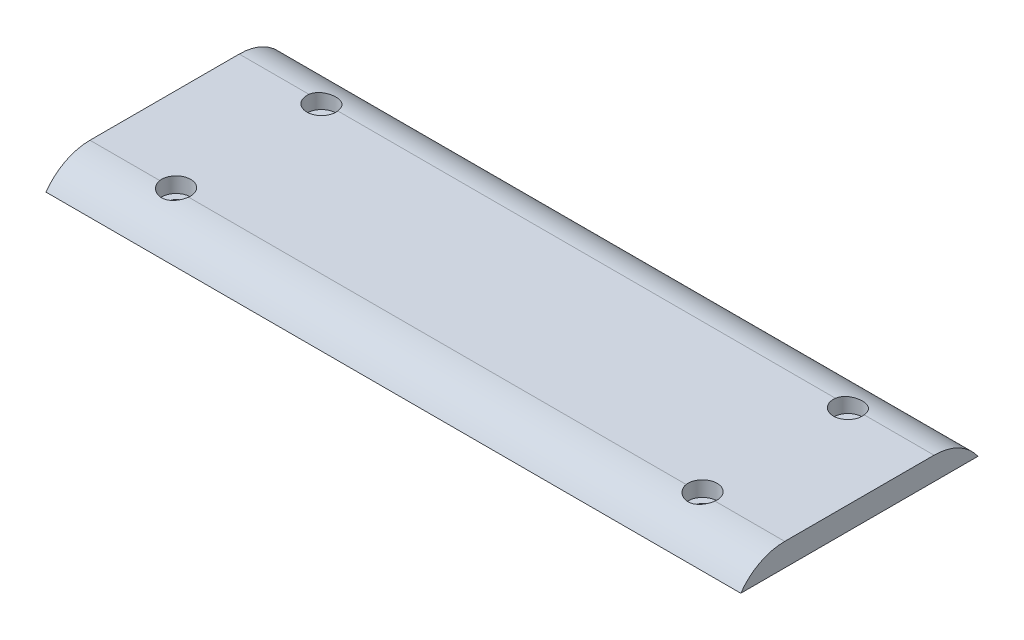
ISO-10303-21;
HEADER;
FILE_DESCRIPTION(('STEP AP214'),'2;1');
FILE_NAME('part.step','',(''),(''),'','','');
FILE_SCHEMA(('AUTOMOTIVE_DESIGN { 1 0 10303 214 1 1 1 1 }'));
ENDSEC;
DATA;
#1=APPLICATION_CONTEXT('core data for automotive mechanical design processes');
#2=APPLICATION_PROTOCOL_DEFINITION('international standard','automotive_design',2000,#1);
#3=PRODUCT_CONTEXT('',#1,'mechanical');
#4=PRODUCT('Part','Part','',(#3));
#5=PRODUCT_RELATED_PRODUCT_CATEGORY('part','',(#4));
#6=PRODUCT_DEFINITION_FORMATION('','',#4);
#7=PRODUCT_DEFINITION_CONTEXT('part definition',#1,'design');
#8=PRODUCT_DEFINITION('design','',#6,#7);
#9=PRODUCT_DEFINITION_SHAPE('','',#8);
#10=(LENGTH_UNIT() NAMED_UNIT(*) SI_UNIT(.MILLI.,.METRE.));
#11=(NAMED_UNIT(*) PLANE_ANGLE_UNIT() SI_UNIT($,.RADIAN.));
#12=(NAMED_UNIT(*) SI_UNIT($,.STERADIAN.) SOLID_ANGLE_UNIT());
#13=UNCERTAINTY_MEASURE_WITH_UNIT(LENGTH_MEASURE(1.E-05),#10,'distance_accuracy_value','');
#14=(GEOMETRIC_REPRESENTATION_CONTEXT(3) GLOBAL_UNCERTAINTY_ASSIGNED_CONTEXT((#13)) GLOBAL_UNIT_ASSIGNED_CONTEXT((#10,
#11,#12)) REPRESENTATION_CONTEXT('',''));
#15=CARTESIAN_POINT('',(0.,0.,0.));
#16=DIRECTION('',(0.,0.,1.));
#17=DIRECTION('',(1.,0.,0.));
#18=AXIS2_PLACEMENT_3D('',#15,#16,#17);
#19=CARTESIAN_POINT('',(0.,0.,0.));
#20=DIRECTION('',(0.,1.,0.));
#21=DIRECTION('',(0.,0.,1.));
#22=AXIS2_PLACEMENT_3D('',#19,#20,#21);
#23=PLANE('',#22);
#24=DIRECTION('',(0.,0.,1.));
#25=VECTOR('',#24,1.);
#26=CARTESIAN_POINT('',(-45.4,0.,-15.5));
#27=LINE('',#26,#25);
#28=CARTESIAN_POINT('',(-45.4,0.,-15.5));
#29=VERTEX_POINT('',#28);
#30=CARTESIAN_POINT('',(-45.4,0.,15.5));
#31=VERTEX_POINT('',#30);
#32=EDGE_CURVE('E220',#29,#31,#27,.T.);
#33=ORIENTED_EDGE('',*,*,#32,.F.);
#34=DIRECTION('',(-1.,0.,0.));
#35=VECTOR('',#34,1.);
#36=CARTESIAN_POINT('',(-45.4,0.,-15.5));
#37=LINE('',#36,#35);
#38=CARTESIAN_POINT('',(45.4,0.,-15.5));
#39=VERTEX_POINT('',#38);
#40=EDGE_CURVE('E226',#39,#29,#37,.T.);
#41=ORIENTED_EDGE('',*,*,#40,.F.);
#42=DIRECTION('',(0.,0.,-1.));
#43=VECTOR('',#42,1.);
#44=CARTESIAN_POINT('',(45.4,0.,-15.5));
#45=LINE('',#44,#43);
#46=CARTESIAN_POINT('',(45.4,0.,15.5));
#47=VERTEX_POINT('',#46);
#48=EDGE_CURVE('E237',#47,#39,#45,.T.);
#49=ORIENTED_EDGE('',*,*,#48,.F.);
#50=DIRECTION('',(1.,0.,0.));
#51=VECTOR('',#50,1.);
#52=CARTESIAN_POINT('',(-45.4,0.,15.5));
#53=LINE('',#52,#51);
#54=EDGE_CURVE('E233',#31,#47,#53,.T.);
#55=ORIENTED_EDGE('',*,*,#54,.F.);
#56=EDGE_LOOP('',(#33,#41,#49,#55));
#57=FACE_BOUND('',#56,.T.);
#58=CARTESIAN_POINT('',(-34.4,0.,-9.5));
#59=DIRECTION('',(0.,1.,0.));
#60=DIRECTION('',(0.,0.,1.));
#61=AXIS2_PLACEMENT_3D('',#58,#59,#60);
#62=CIRCLE('',#61,0.950000000000001);
#63=CARTESIAN_POINT('',(-34.4,0.,-8.55));
#64=VERTEX_POINT('',#63);
#65=EDGE_CURVE('E213',#64,#64,#62,.T.);
#66=ORIENTED_EDGE('',*,*,#65,.T.);
#67=EDGE_LOOP('',(#66));
#68=FACE_BOUND('',#67,.T.);
#69=CARTESIAN_POINT('',(34.4,0.,9.50000000000001));
#70=DIRECTION('',(0.,1.,0.));
#71=DIRECTION('',(0.,0.,1.));
#72=AXIS2_PLACEMENT_3D('',#69,#70,#71);
#73=CIRCLE('',#72,0.950000000000001);
#74=CARTESIAN_POINT('',(34.4,0.,10.45));
#75=VERTEX_POINT('',#74);
#76=EDGE_CURVE('E203',#75,#75,#73,.T.);
#77=ORIENTED_EDGE('',*,*,#76,.T.);
#78=EDGE_LOOP('',(#77));
#79=FACE_BOUND('',#78,.T.);
#80=CARTESIAN_POINT('',(-34.4,0.,9.50000000000001));
#81=DIRECTION('',(0.,1.,0.));
#82=DIRECTION('',(0.,0.,1.));
#83=AXIS2_PLACEMENT_3D('',#80,#81,#82);
#84=CIRCLE('',#83,0.950000000000001);
#85=CARTESIAN_POINT('',(-34.4,0.,10.45));
#86=VERTEX_POINT('',#85);
#87=EDGE_CURVE('E207',#86,#86,#84,.T.);
#88=ORIENTED_EDGE('',*,*,#87,.T.);
#89=EDGE_LOOP('',(#88));
#90=FACE_BOUND('',#89,.T.);
#91=CARTESIAN_POINT('',(34.4,0.,-9.50000000000001));
#92=DIRECTION('',(0.,1.,0.));
#93=DIRECTION('',(0.,0.,1.));
#94=AXIS2_PLACEMENT_3D('',#91,#92,#93);
#95=CIRCLE('',#94,0.950000000000001);
#96=CARTESIAN_POINT('',(34.4,0.,-8.55000000000001));
#97=VERTEX_POINT('',#96);
#98=EDGE_CURVE('E209',#97,#97,#95,.T.);
#99=ORIENTED_EDGE('',*,*,#98,.T.);
#100=EDGE_LOOP('',(#99));
#101=FACE_BOUND('',#100,.T.);
#102=DIRECTION('',(0.,0.,-1.));
#103=VECTOR('',#102,1.);
#104=CARTESIAN_POINT('',(-27.,0.,3.5));
#105=LINE('',#104,#103);
#106=CARTESIAN_POINT('',(-27.,0.,3.5));
#107=VERTEX_POINT('',#106);
#108=CARTESIAN_POINT('',(-27.,0.,-3.5));
#109=VERTEX_POINT('',#108);
#110=EDGE_CURVE('E145',#107,#109,#105,.T.);
#111=ORIENTED_EDGE('',*,*,#110,.F.);
#112=DIRECTION('',(-1.,0.,0.));
#113=VECTOR('',#112,1.);
#114=CARTESIAN_POINT('',(-27.,0.,3.5));
#115=LINE('',#114,#113);
#116=CARTESIAN_POINT('',(27.,0.,3.5));
#117=VERTEX_POINT('',#116);
#118=EDGE_CURVE('E563',#117,#107,#115,.T.);
#119=ORIENTED_EDGE('',*,*,#118,.F.);
#120=DIRECTION('',(0.,0.,1.));
#121=VECTOR('',#120,1.);
#122=CARTESIAN_POINT('',(27.,0.,3.5));
#123=LINE('',#122,#121);
#124=CARTESIAN_POINT('',(27.,0.,-3.5));
#125=VERTEX_POINT('',#124);
#126=EDGE_CURVE('E568',#125,#117,#123,.T.);
#127=ORIENTED_EDGE('',*,*,#126,.F.);
#128=DIRECTION('',(1.,0.,0.));
#129=VECTOR('',#128,1.);
#130=CARTESIAN_POINT('',(-27.,0.,-3.5));
#131=LINE('',#130,#129);
#132=EDGE_CURVE('E159',#109,#125,#131,.T.);
#133=ORIENTED_EDGE('',*,*,#132,.F.);
#134=EDGE_LOOP('',(#111,#119,#127,#133));
#135=FACE_BOUND('',#134,.T.);
#136=ADVANCED_FACE('F39',(#57,#68,#79,#90,#101,#135),#23,.F.);
#137=CARTESIAN_POINT('',(-34.4,0.,-9.5));
#138=DIRECTION('',(0.,1.,0.));
#139=DIRECTION('',(0.,0.,1.));
#140=AXIS2_PLACEMENT_3D('',#137,#138,#139);
#141=CYLINDRICAL_SURFACE('',#140,0.950000000000001);
#142=ORIENTED_EDGE('',*,*,#65,.F.);
#143=EDGE_LOOP('',(#142));
#144=FACE_BOUND('',#143,.T.);
#145=CARTESIAN_POINT('',(-34.4,1.,-9.5));
#146=DIRECTION('',(0.,1.,0.));
#147=DIRECTION('',(0.,0.,1.));
#148=AXIS2_PLACEMENT_3D('',#145,#146,#147);
#149=CIRCLE('',#148,0.950000000000001);
#150=CARTESIAN_POINT('',(-34.4,1.,-8.55));
#151=VERTEX_POINT('',#150);
#152=EDGE_CURVE('E208',#151,#151,#149,.F.);
#153=ORIENTED_EDGE('',*,*,#152,.F.);
#154=EDGE_LOOP('',(#153));
#155=FACE_BOUND('',#154,.T.);
#156=ADVANCED_FACE('F372',(#144,#155),#141,.F.);
#157=CARTESIAN_POINT('',(34.4,0.,9.50000000000001));
#158=DIRECTION('',(0.,1.,0.));
#159=DIRECTION('',(0.,0.,1.));
#160=AXIS2_PLACEMENT_3D('',#157,#158,#159);
#161=CYLINDRICAL_SURFACE('',#160,0.950000000000001);
#162=ORIENTED_EDGE('',*,*,#76,.F.);
#163=EDGE_LOOP('',(#162));
#164=FACE_BOUND('',#163,.T.);
#165=CARTESIAN_POINT('',(34.4,1.,9.50000000000001));
#166=DIRECTION('',(0.,1.,0.));
#167=DIRECTION('',(0.,0.,1.));
#168=AXIS2_PLACEMENT_3D('',#165,#166,#167);
#169=CIRCLE('',#168,0.950000000000001);
#170=CARTESIAN_POINT('',(34.4,1.,10.45));
#171=VERTEX_POINT('',#170);
#172=EDGE_CURVE('E250',#171,#171,#169,.F.);
#173=ORIENTED_EDGE('',*,*,#172,.F.);
#174=EDGE_LOOP('',(#173));
#175=FACE_BOUND('',#174,.T.);
#176=ADVANCED_FACE('F377',(#164,#175),#161,.F.);
#177=CARTESIAN_POINT('',(-34.4,0.,9.50000000000001));
#178=DIRECTION('',(0.,1.,0.));
#179=DIRECTION('',(0.,0.,1.));
#180=AXIS2_PLACEMENT_3D('',#177,#178,#179);
#181=CYLINDRICAL_SURFACE('',#180,0.950000000000001);
#182=ORIENTED_EDGE('',*,*,#87,.F.);
#183=EDGE_LOOP('',(#182));
#184=FACE_BOUND('',#183,.T.);
#185=CARTESIAN_POINT('',(-34.4,1.,9.50000000000001));
#186=DIRECTION('',(0.,1.,0.));
#187=DIRECTION('',(0.,0.,1.));
#188=AXIS2_PLACEMENT_3D('',#185,#186,#187);
#189=CIRCLE('',#188,0.950000000000001);
#190=CARTESIAN_POINT('',(-34.4,1.,10.45));
#191=VERTEX_POINT('',#190);
#192=EDGE_CURVE('E246',#191,#191,#189,.F.);
#193=ORIENTED_EDGE('',*,*,#192,.F.);
#194=EDGE_LOOP('',(#193));
#195=FACE_BOUND('',#194,.T.);
#196=ADVANCED_FACE('F368',(#184,#195),#181,.F.);
#197=CARTESIAN_POINT('',(34.4,0.,-9.50000000000001));
#198=DIRECTION('',(0.,1.,0.));
#199=DIRECTION('',(0.,0.,1.));
#200=AXIS2_PLACEMENT_3D('',#197,#198,#199);
#201=CYLINDRICAL_SURFACE('',#200,0.950000000000001);
#202=ORIENTED_EDGE('',*,*,#98,.F.);
#203=EDGE_LOOP('',(#202));
#204=FACE_BOUND('',#203,.T.);
#205=CARTESIAN_POINT('',(34.4,1.,-9.50000000000001));
#206=DIRECTION('',(0.,1.,0.));
#207=DIRECTION('',(0.,0.,1.));
#208=AXIS2_PLACEMENT_3D('',#205,#206,#207);
#209=CIRCLE('',#208,0.950000000000001);
#210=CARTESIAN_POINT('',(34.4,1.,-8.55000000000001));
#211=VERTEX_POINT('',#210);
#212=EDGE_CURVE('E199',#211,#211,#209,.F.);
#213=ORIENTED_EDGE('',*,*,#212,.F.);
#214=EDGE_LOOP('',(#213));
#215=FACE_BOUND('',#214,.T.);
#216=ADVANCED_FACE('F362',(#204,#215),#201,.F.);
#217=CARTESIAN_POINT('',(-45.4,3.,-15.5));
#218=DIRECTION('',(1.,0.,0.));
#219=DIRECTION('',(0.,0.,-1.));
#220=AXIS2_PLACEMENT_3D('',#217,#218,#219);
#221=PLANE('',#220);
#222=ORIENTED_EDGE('',*,*,#32,.T.);
#223=CARTESIAN_POINT('',(-45.4,-4.,9.75543735346197));
#224=DIRECTION('',(1.,0.,0.));
#225=DIRECTION('',(0.,0.,-1.));
#226=AXIS2_PLACEMENT_3D('',#223,#224,#225);
#227=CIRCLE('',#226,7.);
#228=CARTESIAN_POINT('',(-45.4,3.,9.75543735346197));
#229=VERTEX_POINT('',#228);
#230=EDGE_CURVE('E321',#31,#229,#227,.F.);
#231=ORIENTED_EDGE('',*,*,#230,.T.);
#232=DIRECTION('',(0.,0.,1.));
#233=VECTOR('',#232,1.);
#234=CARTESIAN_POINT('',(-45.4,3.,-15.5));
#235=LINE('',#234,#233);
#236=CARTESIAN_POINT('',(-45.4,3.,-9.75543735346197));
#237=VERTEX_POINT('',#236);
#238=EDGE_CURVE('E221',#237,#229,#235,.T.);
#239=ORIENTED_EDGE('',*,*,#238,.F.);
#240=CARTESIAN_POINT('',(-45.4,-4.,-9.75543735346197));
#241=DIRECTION('',(1.,0.,0.));
#242=DIRECTION('',(0.,0.,-1.));
#243=AXIS2_PLACEMENT_3D('',#240,#241,#242);
#244=CIRCLE('',#243,7.);
#245=EDGE_CURVE('E324',#237,#29,#244,.F.);
#246=ORIENTED_EDGE('',*,*,#245,.T.);
#247=EDGE_LOOP('',(#222,#231,#239,#246));
#248=FACE_BOUND('',#247,.T.);
#249=ADVANCED_FACE('F359',(#248),#221,.F.);
#250=CARTESIAN_POINT('',(45.4,3.,-15.5));
#251=DIRECTION('',(-1.,0.,0.));
#252=DIRECTION('',(0.,0.,1.));
#253=AXIS2_PLACEMENT_3D('',#250,#251,#252);
#254=PLANE('',#253);
#255=DIRECTION('',(0.,0.,-1.));
#256=VECTOR('',#255,1.);
#257=CARTESIAN_POINT('',(45.4,3.,-15.5));
#258=LINE('',#257,#256);
#259=CARTESIAN_POINT('',(45.4,3.,9.75543735346197));
#260=VERTEX_POINT('',#259);
#261=CARTESIAN_POINT('',(45.4,3.,-9.75543735346197));
#262=VERTEX_POINT('',#261);
#263=EDGE_CURVE('E225',#260,#262,#258,.T.);
#264=ORIENTED_EDGE('',*,*,#263,.F.);
#265=CARTESIAN_POINT('',(45.4,-4.,9.75543735346197));
#266=DIRECTION('',(-1.,0.,0.));
#267=DIRECTION('',(0.,0.,1.));
#268=AXIS2_PLACEMENT_3D('',#265,#266,#267);
#269=CIRCLE('',#268,7.);
#270=EDGE_CURVE('E327',#260,#47,#269,.F.);
#271=ORIENTED_EDGE('',*,*,#270,.T.);
#272=ORIENTED_EDGE('',*,*,#48,.T.);
#273=CARTESIAN_POINT('',(45.4,-4.,-9.75543735346197));
#274=DIRECTION('',(-1.,0.,0.));
#275=DIRECTION('',(0.,0.,1.));
#276=AXIS2_PLACEMENT_3D('',#273,#274,#275);
#277=CIRCLE('',#276,7.);
#278=EDGE_CURVE('E61',#39,#262,#277,.F.);
#279=ORIENTED_EDGE('',*,*,#278,.T.);
#280=EDGE_LOOP('',(#264,#271,#272,#279));
#281=FACE_BOUND('',#280,.T.);
#282=ADVANCED_FACE('F340',(#281),#254,.F.);
#283=CARTESIAN_POINT('',(0.,3.,0.));
#284=DIRECTION('',(0.,1.,0.));
#285=DIRECTION('',(0.,0.,1.));
#286=AXIS2_PLACEMENT_3D('',#283,#284,#285);
#287=PLANE('',#286);
#288=ORIENTED_EDGE('',*,*,#238,.T.);
#289=DIRECTION('',(-1.,0.,0.));
#290=VECTOR('',#289,1.);
#291=CARTESIAN_POINT('',(45.4,3.,9.75543735346197));
#292=LINE('',#291,#290);
#293=CARTESIAN_POINT('',(-36.2827511143155,3.,9.75543735346197));
#294=VERTEX_POINT('',#293);
#295=EDGE_CURVE('E274',#229,#294,#292,.F.);
#296=ORIENTED_EDGE('',*,*,#295,.T.);
#297=CARTESIAN_POINT('',(-34.4,3.,9.50000000000001));
#298=DIRECTION('',(0.,1.,0.));
#299=DIRECTION('',(0.,0.,1.));
#300=AXIS2_PLACEMENT_3D('',#297,#298,#299);
#301=CIRCLE('',#300,1.9);
#302=CARTESIAN_POINT('',(-32.5172488856845,3.,9.75543735346197));
#303=VERTEX_POINT('',#302);
#304=EDGE_CURVE('E184',#303,#294,#301,.T.);
#305=ORIENTED_EDGE('',*,*,#304,.F.);
#306=DIRECTION('',(-1.,0.,0.));
#307=VECTOR('',#306,1.);
#308=CARTESIAN_POINT('',(45.4,3.,9.75543735346197));
#309=LINE('',#308,#307);
#310=CARTESIAN_POINT('',(32.5172488856845,3.,9.75543735346197));
#311=VERTEX_POINT('',#310);
#312=EDGE_CURVE('E271',#303,#311,#309,.F.);
#313=ORIENTED_EDGE('',*,*,#312,.T.);
#314=CARTESIAN_POINT('',(34.4,3.,9.50000000000001));
#315=DIRECTION('',(0.,1.,0.));
#316=DIRECTION('',(0.,0.,1.));
#317=AXIS2_PLACEMENT_3D('',#314,#315,#316);
#318=CIRCLE('',#317,1.9);
#319=CARTESIAN_POINT('',(36.2827511143155,3.,9.75543735346197));
#320=VERTEX_POINT('',#319);
#321=EDGE_CURVE('E165',#320,#311,#318,.T.);
#322=ORIENTED_EDGE('',*,*,#321,.F.);
#323=DIRECTION('',(-1.,0.,0.));
#324=VECTOR('',#323,1.);
#325=CARTESIAN_POINT('',(45.4,3.,9.75543735346197));
#326=LINE('',#325,#324);
#327=EDGE_CURVE('E68',#320,#260,#326,.F.);
#328=ORIENTED_EDGE('',*,*,#327,.T.);
#329=ORIENTED_EDGE('',*,*,#263,.T.);
#330=DIRECTION('',(1.,0.,0.));
#331=VECTOR('',#330,1.);
#332=CARTESIAN_POINT('',(-45.4,3.,-9.75543735346197));
#333=LINE('',#332,#331);
#334=CARTESIAN_POINT('',(36.2827511143155,3.,-9.75543735346197));
#335=VERTEX_POINT('',#334);
#336=EDGE_CURVE('E265',#262,#335,#333,.F.);
#337=ORIENTED_EDGE('',*,*,#336,.T.);
#338=CARTESIAN_POINT('',(34.4,3.,-9.50000000000001));
#339=DIRECTION('',(0.,1.,0.));
#340=DIRECTION('',(0.,0.,1.));
#341=AXIS2_PLACEMENT_3D('',#338,#339,#340);
#342=CIRCLE('',#341,1.9);
#343=CARTESIAN_POINT('',(32.5172488856845,3.,-9.75543735346197));
#344=VERTEX_POINT('',#343);
#345=EDGE_CURVE('E175',#344,#335,#342,.T.);
#346=ORIENTED_EDGE('',*,*,#345,.F.);
#347=DIRECTION('',(1.,0.,0.));
#348=VECTOR('',#347,1.);
#349=CARTESIAN_POINT('',(-45.4,3.,-9.75543735346197));
#350=LINE('',#349,#348);
#351=CARTESIAN_POINT('',(-32.5172488856845,3.,-9.75543735346197));
#352=VERTEX_POINT('',#351);
#353=EDGE_CURVE('E262',#344,#352,#350,.F.);
#354=ORIENTED_EDGE('',*,*,#353,.T.);
#355=CARTESIAN_POINT('',(-34.4,3.,-9.5));
#356=DIRECTION('',(0.,1.,0.));
#357=DIRECTION('',(0.,0.,1.));
#358=AXIS2_PLACEMENT_3D('',#355,#356,#357);
#359=CIRCLE('',#358,1.9);
#360=CARTESIAN_POINT('',(-36.2827511143155,3.,-9.75543735346197));
#361=VERTEX_POINT('',#360);
#362=EDGE_CURVE('E183',#361,#352,#359,.T.);
#363=ORIENTED_EDGE('',*,*,#362,.F.);
#364=DIRECTION('',(1.,0.,0.));
#365=VECTOR('',#364,1.);
#366=CARTESIAN_POINT('',(-45.4,3.,-9.75543735346197));
#367=LINE('',#366,#365);
#368=EDGE_CURVE('E259',#361,#237,#367,.F.);
#369=ORIENTED_EDGE('',*,*,#368,.T.);
#370=EDGE_LOOP('',(#288,#296,#305,#313,#322,#328,#329,#337,#346,#354,#363,#369));
#371=FACE_BOUND('',#370,.T.);
#372=ADVANCED_FACE('F308',(#371),#287,.T.);
#373=CARTESIAN_POINT('',(34.4,1.,-9.50000000000001));
#374=DIRECTION('',(0.,1.,0.));
#375=DIRECTION('',(0.,0.,1.));
#376=AXIS2_PLACEMENT_3D('',#373,#374,#375);
#377=PLANE('',#376);
#378=CARTESIAN_POINT('',(34.4,1.,-9.50000000000001));
#379=DIRECTION('',(0.,1.,0.));
#380=DIRECTION('',(0.,0.,1.));
#381=AXIS2_PLACEMENT_3D('',#378,#379,#380);
#382=CIRCLE('',#381,1.9);
#383=CARTESIAN_POINT('',(34.4,1.,-7.60000000000001));
#384=VERTEX_POINT('',#383);
#385=EDGE_CURVE('E188',#384,#384,#382,.T.);
#386=ORIENTED_EDGE('',*,*,#385,.T.);
#387=EDGE_LOOP('',(#386));
#388=FACE_BOUND('',#387,.T.);
#389=ORIENTED_EDGE('',*,*,#212,.T.);
#390=EDGE_LOOP('',(#389));
#391=FACE_BOUND('',#390,.T.);
#392=ADVANCED_FACE('F304',(#388,#391),#377,.T.);
#393=CARTESIAN_POINT('',(34.4,1.,-9.50000000000001));
#394=DIRECTION('',(0.,1.,0.));
#395=DIRECTION('',(0.,0.,1.));
#396=AXIS2_PLACEMENT_3D('',#393,#394,#395);
#397=CYLINDRICAL_SURFACE('',#396,1.9);
#398=ORIENTED_EDGE('',*,*,#385,.F.);
#399=EDGE_LOOP('',(#398));
#400=FACE_BOUND('',#399,.T.);
#401=ORIENTED_EDGE('',*,*,#345,.T.);
#402=CARTESIAN_POINT('',(36.2827511143155,3.,-9.75543735346197));
#403=CARTESIAN_POINT('',(36.2756699547388,3.00000313751028,-9.80763539384835));
#404=CARTESIAN_POINT('',(36.2664190101095,2.99941551765948,-9.85951192953368));
#405=CARTESIAN_POINT('',(36.2436548531395,2.99713143928708,-9.96228605572565));
#406=CARTESIAN_POINT('',(36.2301424704268,2.99543519652624,-10.0131838347346));
#407=CARTESIAN_POINT('',(36.1834111984001,2.98880456317192,-10.1636538114941));
#408=CARTESIAN_POINT('',(36.1439575577971,2.98232745510877,-10.2612990364077));
#409=CARTESIAN_POINT('',(36.0496678256805,2.96624432714123,-10.4484690033715));
#410=CARTESIAN_POINT('',(35.9948346834494,2.95663890708727,-10.5379952980137));
#411=CARTESIAN_POINT('',(35.8713164666124,2.93558264692736,-10.7067133965414));
#412=CARTESIAN_POINT('',(35.8026275241312,2.92413129170448,-10.7859023045344));
#413=CARTESIAN_POINT('',(35.651738209674,2.90059510133223,-10.9333525359398));
#414=CARTESIAN_POINT('',(35.5692971515987,2.88850221119227,-11.0013663324708));
#415=CARTESIAN_POINT('',(35.3940748570098,2.86545007584048,-11.122704977905));
#416=CARTESIAN_POINT('',(35.3012926903495,2.85449093277648,-11.1760285039694));
#417=CARTESIAN_POINT('',(35.1072632420762,2.83507041556186,-11.2667244960009));
#418=CARTESIAN_POINT('',(35.0059668758048,2.82662500917759,-11.303995635108));
#419=CARTESIAN_POINT('',(34.7983106954772,2.81346959521531,-11.3608954358823));
#420=CARTESIAN_POINT('',(34.6919520454549,2.80875873326367,-11.3805281329364));
#421=CARTESIAN_POINT('',(34.4799140161164,2.80378319506307,-11.401233653554));
#422=CARTESIAN_POINT('',(34.3742791982172,2.80341490480225,-11.4027390151352));
#423=CARTESIAN_POINT('',(34.1642920393454,2.80690473134939,-11.3882575559887));
#424=CARTESIAN_POINT('',(34.05993963663,2.8107626438715,-11.3722715807557));
#425=CARTESIAN_POINT('',(33.8567086752251,2.82212412972829,-11.3236303674582));
#426=CARTESIAN_POINT('',(33.7577805341995,2.82958473816853,-11.2911713560917));
#427=CARTESIAN_POINT('',(33.5667348414324,2.84718658764419,-11.210677459047));
#428=CARTESIAN_POINT('',(33.4746181922251,2.85732818310331,-11.1626405137915));
#429=CARTESIAN_POINT('',(33.2977172750897,2.87927024183779,-11.0511704979263));
#430=CARTESIAN_POINT('',(33.213125817267,2.89110087097977,-10.9874374389715));
#431=CARTESIAN_POINT('',(33.0556631459885,2.91476488201027,-10.8468121421074));
#432=CARTESIAN_POINT('',(32.9827947118162,2.92659826388744,-10.7699167925869));
#433=CARTESIAN_POINT('',(32.8495449812491,2.94895672594959,-10.6034765655789));
#434=CARTESIAN_POINT('',(32.789412646922,2.95945435562963,-10.5137285288257));
#435=CARTESIAN_POINT('',(32.685148671804,2.97741824822054,-10.325145480624));
#436=CARTESIAN_POINT('',(32.6410013099978,2.98488749038251,-10.2263195178136));
#437=CARTESIAN_POINT('',(32.5847234443796,2.99342618391652,-10.0646192693312));
#438=CARTESIAN_POINT('',(32.5668987877359,2.99586465633369,-10.0037395706235));
#439=CARTESIAN_POINT('',(32.5374210692818,2.99915480206904,-9.88053882412523));
#440=CARTESIAN_POINT('',(32.5257607635036,3.0000083408824,-9.8182195583544));
#441=CARTESIAN_POINT('',(32.5172488856845,3.,-9.75543735346197));
#442=B_SPLINE_CURVE_WITH_KNOTS('',3,(#402,#403,#404,#405,#406,#407,#408,#409,#410,#411,#412,
#413,#414,#415,#416,#417,#418,#419,#420,#421,#422,#423,#424,#425,#426,#427,#428,#429,#430,#431,
#432,#433,#434,#435,#436,#437,#438,#439,#440,#441),.UNSPECIFIED.,.F.,.F.,(4,2,2,2,2,2,2,2,2,2,2,
2,2,2,2,2,2,2,2,4),(0.,0.157927180364455,0.31582363400812,0.63073080318749,0.945577624774229,
1.26051245843667,1.58168558788837,1.90288762909844,2.22608848007829,2.54921536914822,
2.86461638192143,3.18000214953873,3.49171626151796,3.80347160240495,4.12172382700475,
4.44005139170789,4.76412115781495,5.08787133416603,5.27801209333749,5.4679289112326),.UNSPECIFIED.);
#443=EDGE_CURVE('E54',#335,#344,#442,.T.);
#444=ORIENTED_EDGE('',*,*,#443,.T.);
#445=EDGE_LOOP('',(#401,#444));
#446=FACE_BOUND('',#445,.T.);
#447=ADVANCED_FACE('F307',(#400,#446),#397,.F.);
#448=CARTESIAN_POINT('',(-34.4,1.,9.50000000000001));
#449=DIRECTION('',(0.,1.,0.));
#450=DIRECTION('',(0.,0.,1.));
#451=AXIS2_PLACEMENT_3D('',#448,#449,#450);
#452=PLANE('',#451);
#453=CARTESIAN_POINT('',(-34.4,1.,9.50000000000001));
#454=DIRECTION('',(0.,1.,0.));
#455=DIRECTION('',(0.,0.,1.));
#456=AXIS2_PLACEMENT_3D('',#453,#454,#455);
#457=CIRCLE('',#456,1.9);
#458=CARTESIAN_POINT('',(-34.4,1.,11.4));
#459=VERTEX_POINT('',#458);
#460=EDGE_CURVE('E179',#459,#459,#457,.T.);
#461=ORIENTED_EDGE('',*,*,#460,.T.);
#462=EDGE_LOOP('',(#461));
#463=FACE_BOUND('',#462,.T.);
#464=ORIENTED_EDGE('',*,*,#192,.T.);
#465=EDGE_LOOP('',(#464));
#466=FACE_BOUND('',#465,.T.);
#467=ADVANCED_FACE('F302',(#463,#466),#452,.T.);
#468=CARTESIAN_POINT('',(-34.4,1.,9.50000000000001));
#469=DIRECTION('',(0.,1.,0.));
#470=DIRECTION('',(0.,0.,1.));
#471=AXIS2_PLACEMENT_3D('',#468,#469,#470);
#472=CYLINDRICAL_SURFACE('',#471,1.9);
#473=ORIENTED_EDGE('',*,*,#460,.F.);
#474=EDGE_LOOP('',(#473));
#475=FACE_BOUND('',#474,.T.);
#476=ORIENTED_EDGE('',*,*,#304,.T.);
#477=CARTESIAN_POINT('',(-36.2827511143155,3.,9.75543735346197));
#478=CARTESIAN_POINT('',(-36.2756699547388,3.00000313751028,9.80763539384835));
#479=CARTESIAN_POINT('',(-36.2664190101095,2.99941551765948,9.85951192953368));
#480=CARTESIAN_POINT('',(-36.2436548531395,2.99713143928708,9.96228605572565));
#481=CARTESIAN_POINT('',(-36.2301424704268,2.99543519652624,10.0131838347346));
#482=CARTESIAN_POINT('',(-36.1834111984001,2.98880456317192,10.1636538114941));
#483=CARTESIAN_POINT('',(-36.1439575577971,2.98232745510877,10.2612990364077));
#484=CARTESIAN_POINT('',(-36.0496678256805,2.96624432714123,10.4484690033715));
#485=CARTESIAN_POINT('',(-35.9948346834494,2.95663890708727,10.5379952980137));
#486=CARTESIAN_POINT('',(-35.8713164666124,2.93558264692736,10.7067133965414));
#487=CARTESIAN_POINT('',(-35.8026275241312,2.92413129170448,10.7859023045344));
#488=CARTESIAN_POINT('',(-35.651738209674,2.90059510133223,10.9333525359398));
#489=CARTESIAN_POINT('',(-35.5692971515987,2.88850221119227,11.0013663324708));
#490=CARTESIAN_POINT('',(-35.3940748570098,2.86545007584048,11.122704977905));
#491=CARTESIAN_POINT('',(-35.3012926903495,2.85449093277648,11.1760285039694));
#492=CARTESIAN_POINT('',(-35.1072632420762,2.83507041556186,11.2667244960009));
#493=CARTESIAN_POINT('',(-35.0059668758048,2.82662500917759,11.303995635108));
#494=CARTESIAN_POINT('',(-34.7983106954772,2.81346959521531,11.3608954358823));
#495=CARTESIAN_POINT('',(-34.6919520454549,2.80875873326367,11.3805281329364));
#496=CARTESIAN_POINT('',(-34.4799140161164,2.80378319506307,11.401233653554));
#497=CARTESIAN_POINT('',(-34.3742791982172,2.80341490480225,11.4027390151352));
#498=CARTESIAN_POINT('',(-34.1642920393454,2.80690473134939,11.3882575559887));
#499=CARTESIAN_POINT('',(-34.05993963663,2.8107626438715,11.3722715807557));
#500=CARTESIAN_POINT('',(-33.8567086752251,2.82212412972829,11.3236303674582));
#501=CARTESIAN_POINT('',(-33.7577805341995,2.82958473816853,11.2911713560917));
#502=CARTESIAN_POINT('',(-33.5667348414324,2.84718658764419,11.210677459047));
#503=CARTESIAN_POINT('',(-33.4746181922251,2.85732818310331,11.1626405137915));
#504=CARTESIAN_POINT('',(-33.2977172750897,2.87927024183779,11.0511704979263));
#505=CARTESIAN_POINT('',(-33.213125817267,2.89110087097977,10.9874374389715));
#506=CARTESIAN_POINT('',(-33.0556631459885,2.91476488201027,10.8468121421074));
#507=CARTESIAN_POINT('',(-32.9827947118162,2.92659826388744,10.7699167925869));
#508=CARTESIAN_POINT('',(-32.8495449812491,2.94895672594959,10.6034765655789));
#509=CARTESIAN_POINT('',(-32.789412646922,2.95945435562963,10.5137285288257));
#510=CARTESIAN_POINT('',(-32.685148671804,2.97741824822054,10.325145480624));
#511=CARTESIAN_POINT('',(-32.6410013099978,2.98488749038251,10.2263195178136));
#512=CARTESIAN_POINT('',(-32.5847234443796,2.99342618391652,10.0646192693312));
#513=CARTESIAN_POINT('',(-32.5668987877359,2.99586465633369,10.0037395706235));
#514=CARTESIAN_POINT('',(-32.5374210692818,2.99915480206904,9.88053882412523));
#515=CARTESIAN_POINT('',(-32.5257607635036,3.0000083408824,9.8182195583544));
#516=CARTESIAN_POINT('',(-32.5172488856845,3.,9.75543735346197));
#517=B_SPLINE_CURVE_WITH_KNOTS('',3,(#477,#478,#479,#480,#481,#482,#483,#484,#485,#486,#487,
#488,#489,#490,#491,#492,#493,#494,#495,#496,#497,#498,#499,#500,#501,#502,#503,#504,#505,#506,
#507,#508,#509,#510,#511,#512,#513,#514,#515,#516),.UNSPECIFIED.,.F.,.F.,(4,2,2,2,2,2,2,2,2,2,2,
2,2,2,2,2,2,2,2,4),(0.,0.157927180364455,0.31582363400812,0.63073080318749,0.945577624774229,
1.26051245843667,1.58168558788837,1.90288762909844,2.22608848007829,2.54921536914822,
2.86461638192143,3.18000214953873,3.49171626151796,3.80347160240495,4.12172382700475,
4.44005139170789,4.76412115781495,5.08787133416603,5.27801209333749,5.4679289112326),.UNSPECIFIED.);
#518=EDGE_CURVE('E278',#294,#303,#517,.T.);
#519=ORIENTED_EDGE('',*,*,#518,.T.);
#520=EDGE_LOOP('',(#476,#519));
#521=FACE_BOUND('',#520,.T.);
#522=ADVANCED_FACE('F296',(#475,#521),#472,.F.);
#523=CARTESIAN_POINT('',(34.4,1.,9.50000000000001));
#524=DIRECTION('',(0.,1.,0.));
#525=DIRECTION('',(0.,0.,1.));
#526=AXIS2_PLACEMENT_3D('',#523,#524,#525);
#527=PLANE('',#526);
#528=CARTESIAN_POINT('',(34.4,1.,9.50000000000001));
#529=DIRECTION('',(0.,1.,0.));
#530=DIRECTION('',(0.,0.,1.));
#531=AXIS2_PLACEMENT_3D('',#528,#529,#530);
#532=CIRCLE('',#531,1.9);
#533=CARTESIAN_POINT('',(34.4,1.,11.4));
#534=VERTEX_POINT('',#533);
#535=EDGE_CURVE('E171',#534,#534,#532,.T.);
#536=ORIENTED_EDGE('',*,*,#535,.T.);
#537=EDGE_LOOP('',(#536));
#538=FACE_BOUND('',#537,.T.);
#539=ORIENTED_EDGE('',*,*,#172,.T.);
#540=EDGE_LOOP('',(#539));
#541=FACE_BOUND('',#540,.T.);
#542=ADVANCED_FACE('F301',(#538,#541),#527,.T.);
#543=CARTESIAN_POINT('',(34.4,1.,9.50000000000001));
#544=DIRECTION('',(0.,1.,0.));
#545=DIRECTION('',(0.,0.,1.));
#546=AXIS2_PLACEMENT_3D('',#543,#544,#545);
#547=CYLINDRICAL_SURFACE('',#546,1.9);
#548=ORIENTED_EDGE('',*,*,#535,.F.);
#549=EDGE_LOOP('',(#548));
#550=FACE_BOUND('',#549,.T.);
#551=ORIENTED_EDGE('',*,*,#321,.T.);
#552=CARTESIAN_POINT('',(32.5172488856845,3.,9.75543735346197));
#553=CARTESIAN_POINT('',(32.5243300452612,3.00000313751028,9.80763539384835));
#554=CARTESIAN_POINT('',(32.5335809898905,2.99941551765948,9.85951192953368));
#555=CARTESIAN_POINT('',(32.5563451468605,2.99713143928708,9.96228605572565));
#556=CARTESIAN_POINT('',(32.5698575295732,2.99543519652624,10.0131838347346));
#557=CARTESIAN_POINT('',(32.6165888015999,2.98880456317192,10.1636538114941));
#558=CARTESIAN_POINT('',(32.6560424422029,2.98232745510877,10.2612990364077));
#559=CARTESIAN_POINT('',(32.7503321743195,2.96624432714123,10.4484690033715));
#560=CARTESIAN_POINT('',(32.8051653165506,2.95663890708727,10.5379952980137));
#561=CARTESIAN_POINT('',(32.9286835333876,2.93558264692736,10.7067133965414));
#562=CARTESIAN_POINT('',(32.9973724758688,2.92413129170448,10.7859023045344));
#563=CARTESIAN_POINT('',(33.148261790326,2.90059510133223,10.9333525359398));
#564=CARTESIAN_POINT('',(33.2307028484013,2.88850221119227,11.0013663324708));
#565=CARTESIAN_POINT('',(33.4059251429902,2.86545007584048,11.122704977905));
#566=CARTESIAN_POINT('',(33.4987073096505,2.85449093277648,11.1760285039694));
#567=CARTESIAN_POINT('',(33.6927367579238,2.83507041556186,11.2667244960009));
#568=CARTESIAN_POINT('',(33.7940331241952,2.82662500917759,11.303995635108));
#569=CARTESIAN_POINT('',(34.0016893045228,2.81346959521531,11.3608954358823));
#570=CARTESIAN_POINT('',(34.1080479545451,2.80875873326367,11.3805281329364));
#571=CARTESIAN_POINT('',(34.3200859838836,2.80378319506307,11.401233653554));
#572=CARTESIAN_POINT('',(34.4257208017828,2.80341490480225,11.4027390151352));
#573=CARTESIAN_POINT('',(34.6357079606546,2.80690473134939,11.3882575559887));
#574=CARTESIAN_POINT('',(34.74006036337,2.8107626438715,11.3722715807557));
#575=CARTESIAN_POINT('',(34.9432913247749,2.82212412972829,11.3236303674582));
#576=CARTESIAN_POINT('',(35.0422194658005,2.82958473816853,11.2911713560917));
#577=CARTESIAN_POINT('',(35.2332651585676,2.84718658764419,11.210677459047));
#578=CARTESIAN_POINT('',(35.3253818077749,2.85732818310331,11.1626405137915));
#579=CARTESIAN_POINT('',(35.5022827249103,2.87927024183779,11.0511704979263));
#580=CARTESIAN_POINT('',(35.586874182733,2.89110087097977,10.9874374389715));
#581=CARTESIAN_POINT('',(35.7443368540115,2.91476488201027,10.8468121421074));
#582=CARTESIAN_POINT('',(35.8172052881838,2.92659826388744,10.7699167925869));
#583=CARTESIAN_POINT('',(35.9504550187509,2.94895672594959,10.6034765655789));
#584=CARTESIAN_POINT('',(36.010587353078,2.95945435562963,10.5137285288257));
#585=CARTESIAN_POINT('',(36.114851328196,2.97741824822054,10.325145480624));
#586=CARTESIAN_POINT('',(36.1589986900022,2.98488749038251,10.2263195178136));
#587=CARTESIAN_POINT('',(36.2152765556204,2.99342618391652,10.0646192693312));
#588=CARTESIAN_POINT('',(36.2331012122641,2.99586465633369,10.0037395706235));
#589=CARTESIAN_POINT('',(36.2625789307182,2.99915480206904,9.88053882412523));
#590=CARTESIAN_POINT('',(36.2742392364964,3.0000083408824,9.8182195583544));
#591=CARTESIAN_POINT('',(36.2827511143155,3.,9.75543735346197));
#592=B_SPLINE_CURVE_WITH_KNOTS('',3,(#552,#553,#554,#555,#556,#557,#558,#559,#560,#561,#562,
#563,#564,#565,#566,#567,#568,#569,#570,#571,#572,#573,#574,#575,#576,#577,#578,#579,#580,#581,
#582,#583,#584,#585,#586,#587,#588,#589,#590,#591),.UNSPECIFIED.,.F.,.F.,(4,2,2,2,2,2,2,2,2,2,2,
2,2,2,2,2,2,2,2,4),(0.,0.157927180364456,0.31582363400812,0.63073080318749,0.945577624774229,
1.26051245843667,1.58168558788837,1.90288762909844,2.22608848007828,2.54921536914822,
2.86461638192143,3.18000214953873,3.49171626151796,3.80347160240495,4.12172382700475,
4.44005139170789,4.76412115781495,5.08787133416603,5.27801209333749,5.4679289112326),.UNSPECIFIED.);
#593=EDGE_CURVE('E286',#311,#320,#592,.T.);
#594=ORIENTED_EDGE('',*,*,#593,.T.);
#595=EDGE_LOOP('',(#551,#594));
#596=FACE_BOUND('',#595,.T.);
#597=ADVANCED_FACE('F333',(#550,#596),#547,.F.);
#598=CARTESIAN_POINT('',(-34.4,1.,-9.5));
#599=DIRECTION('',(0.,1.,0.));
#600=DIRECTION('',(0.,0.,1.));
#601=AXIS2_PLACEMENT_3D('',#598,#599,#600);
#602=PLANE('',#601);
#603=CARTESIAN_POINT('',(-34.4,1.,-9.5));
#604=DIRECTION('',(0.,1.,0.));
#605=DIRECTION('',(0.,0.,1.));
#606=AXIS2_PLACEMENT_3D('',#603,#604,#605);
#607=CIRCLE('',#606,1.9);
#608=CARTESIAN_POINT('',(-34.4,1.,-7.6));
#609=VERTEX_POINT('',#608);
#610=EDGE_CURVE('E195',#609,#609,#607,.T.);
#611=ORIENTED_EDGE('',*,*,#610,.T.);
#612=EDGE_LOOP('',(#611));
#613=FACE_BOUND('',#612,.T.);
#614=ORIENTED_EDGE('',*,*,#152,.T.);
#615=EDGE_LOOP('',(#614));
#616=FACE_BOUND('',#615,.T.);
#617=ADVANCED_FACE('F314',(#613,#616),#602,.T.);
#618=CARTESIAN_POINT('',(-34.4,1.,-9.5));
#619=DIRECTION('',(0.,1.,0.));
#620=DIRECTION('',(0.,0.,1.));
#621=AXIS2_PLACEMENT_3D('',#618,#619,#620);
#622=CYLINDRICAL_SURFACE('',#621,1.9);
#623=ORIENTED_EDGE('',*,*,#610,.F.);
#624=EDGE_LOOP('',(#623));
#625=FACE_BOUND('',#624,.T.);
#626=ORIENTED_EDGE('',*,*,#362,.T.);
#627=CARTESIAN_POINT('',(-32.5172488856845,3.,-9.75543735346197));
#628=CARTESIAN_POINT('',(-32.5243300452612,3.00000313751028,-9.80763539384835));
#629=CARTESIAN_POINT('',(-32.5335809898905,2.99941551765948,-9.85951192953368));
#630=CARTESIAN_POINT('',(-32.5563451468605,2.99713143928708,-9.96228605572565));
#631=CARTESIAN_POINT('',(-32.5698575295732,2.99543519652624,-10.0131838347346));
#632=CARTESIAN_POINT('',(-32.6165888015999,2.98880456317192,-10.1636538114941));
#633=CARTESIAN_POINT('',(-32.656042442203,2.98232745510877,-10.2612990364077));
#634=CARTESIAN_POINT('',(-32.7503321743195,2.96624432714123,-10.4484690033715));
#635=CARTESIAN_POINT('',(-32.8051653165507,2.95663890708727,-10.5379952980137));
#636=CARTESIAN_POINT('',(-32.9286835333876,2.93558264692736,-10.7067133965414));
#637=CARTESIAN_POINT('',(-32.9973724758688,2.92413129170448,-10.7859023045344));
#638=CARTESIAN_POINT('',(-33.148261790326,2.90059510133223,-10.9333525359398));
#639=CARTESIAN_POINT('',(-33.2307028484013,2.88850221119227,-11.0013663324708));
#640=CARTESIAN_POINT('',(-33.4059251429902,2.86545007584048,-11.122704977905));
#641=CARTESIAN_POINT('',(-33.4987073096505,2.85449093277648,-11.1760285039694));
#642=CARTESIAN_POINT('',(-33.6927367579239,2.83507041556186,-11.2667244960009));
#643=CARTESIAN_POINT('',(-33.7940331241952,2.82662500917759,-11.303995635108));
#644=CARTESIAN_POINT('',(-34.0016893045228,2.81346959521531,-11.3608954358822));
#645=CARTESIAN_POINT('',(-34.1080479545451,2.80875873326367,-11.3805281329364));
#646=CARTESIAN_POINT('',(-34.3200859838836,2.80378319506308,-11.401233653554));
#647=CARTESIAN_POINT('',(-34.4257208017828,2.80341490480225,-11.4027390151352));
#648=CARTESIAN_POINT('',(-34.6357079606547,2.80690473134939,-11.3882575559887));
#649=CARTESIAN_POINT('',(-34.74006036337,2.81076264387151,-11.3722715807557));
#650=CARTESIAN_POINT('',(-34.943291324775,2.82212412972829,-11.3236303674582));
#651=CARTESIAN_POINT('',(-35.0422194658005,2.82958473816853,-11.2911713560917));
#652=CARTESIAN_POINT('',(-35.2332651585676,2.84718658764419,-11.210677459047));
#653=CARTESIAN_POINT('',(-35.3253818077749,2.85732818310332,-11.1626405137915));
#654=CARTESIAN_POINT('',(-35.5022827249103,2.87927024183779,-11.0511704979263));
#655=CARTESIAN_POINT('',(-35.586874182733,2.89110087097977,-10.9874374389715));
#656=CARTESIAN_POINT('',(-35.7443368540115,2.91476488201027,-10.8468121421074));
#657=CARTESIAN_POINT('',(-35.8172052881838,2.92659826388744,-10.7699167925869));
#658=CARTESIAN_POINT('',(-35.9504550187509,2.94895672594959,-10.6034765655788));
#659=CARTESIAN_POINT('',(-36.010587353078,2.95945435562963,-10.5137285288256));
#660=CARTESIAN_POINT('',(-36.114851328196,2.97741824822054,-10.3251454806239));
#661=CARTESIAN_POINT('',(-36.1589986900022,2.98488749038251,-10.2263195178136));
#662=CARTESIAN_POINT('',(-36.2152765556204,2.99342618391652,-10.0646192693312));
#663=CARTESIAN_POINT('',(-36.2331012122641,2.99586465633369,-10.0037395706235));
#664=CARTESIAN_POINT('',(-36.2625789307182,2.99915480206904,-9.88053882412522));
#665=CARTESIAN_POINT('',(-36.2742392364964,3.0000083408824,-9.81821955835439));
#666=CARTESIAN_POINT('',(-36.2827511143155,3.,-9.75543735346197));
#667=B_SPLINE_CURVE_WITH_KNOTS('',3,(#627,#628,#629,#630,#631,#632,#633,#634,#635,#636,#637,
#638,#639,#640,#641,#642,#643,#644,#645,#646,#647,#648,#649,#650,#651,#652,#653,#654,#655,#656,
#657,#658,#659,#660,#661,#662,#663,#664,#665,#666),.UNSPECIFIED.,.F.,.F.,(4,2,2,2,2,2,2,2,2,2,2,
2,2,2,2,2,2,2,2,4),(0.,0.157927180364455,0.315823634008124,0.630730803187494,0.945577624774243,
1.26051245843667,1.58168558788837,1.90288762909845,2.22608848007829,2.54921536914822,
2.86461638192144,3.18000214953873,3.49171626151796,3.80347160240495,4.12172382700476,
4.44005139170791,4.76412115781496,5.08787133416604,5.27801209333749,5.46792891123259),.UNSPECIFIED.);
#668=EDGE_CURVE('E11',#352,#361,#667,.T.);
#669=ORIENTED_EDGE('',*,*,#668,.T.);
#670=EDGE_LOOP('',(#626,#669));
#671=FACE_BOUND('',#670,.T.);
#672=ADVANCED_FACE('F355',(#625,#671),#622,.F.);
#673=CARTESIAN_POINT('',(-27.,-5.,3.5));
#674=DIRECTION('',(1.,0.,0.));
#675=DIRECTION('',(0.,0.,-1.));
#676=AXIS2_PLACEMENT_3D('',#673,#674,#675);
#677=PLANE('',#676);
#678=DIRECTION('',(0.,1.,0.));
#679=VECTOR('',#678,1.);
#680=CARTESIAN_POINT('',(-27.,-5.,-3.5));
#681=LINE('',#680,#679);
#682=CARTESIAN_POINT('',(-27.,-4.41019351391354,-3.5));
#683=VERTEX_POINT('',#682);
#684=EDGE_CURVE('E161',#683,#109,#681,.T.);
#685=ORIENTED_EDGE('',*,*,#684,.F.);
#686=CARTESIAN_POINT('',(-27.,-6.13065856732207,0.));
#687=DIRECTION('',(1.,0.,0.));
#688=DIRECTION('',(0.,0.,-1.));
#689=AXIS2_PLACEMENT_3D('',#686,#687,#688);
#690=CIRCLE('',#689,3.9);
#691=CARTESIAN_POINT('',(-27.,-4.41019351391354,3.5));
#692=VERTEX_POINT('',#691);
#693=EDGE_CURVE('E140',#683,#692,#690,.T.);
#694=ORIENTED_EDGE('',*,*,#693,.T.);
#695=DIRECTION('',(0.,1.,0.));
#696=VECTOR('',#695,1.);
#697=CARTESIAN_POINT('',(-27.,-5.,3.5));
#698=LINE('',#697,#696);
#699=EDGE_CURVE('E167',#692,#107,#698,.T.);
#700=ORIENTED_EDGE('',*,*,#699,.T.);
#701=ORIENTED_EDGE('',*,*,#110,.T.);
#702=EDGE_LOOP('',(#685,#694,#700,#701));
#703=FACE_BOUND('',#702,.T.);
#704=ADVANCED_FACE('F390',(#703),#677,.F.);
#705=CARTESIAN_POINT('',(-27.,-5.,-3.5));
#706=DIRECTION('',(0.,0.,1.));
#707=DIRECTION('',(1.,0.,0.));
#708=AXIS2_PLACEMENT_3D('',#705,#706,#707);
#709=PLANE('',#708);
#710=DIRECTION('',(0.,1.,0.));
#711=VECTOR('',#710,1.);
#712=CARTESIAN_POINT('',(27.,-5.,-3.5));
#713=LINE('',#712,#711);
#714=CARTESIAN_POINT('',(27.,-4.41019351391354,-3.5));
#715=VERTEX_POINT('',#714);
#716=EDGE_CURVE('E151',#715,#125,#713,.T.);
#717=ORIENTED_EDGE('',*,*,#716,.F.);
#718=DIRECTION('',(1.,0.,0.));
#719=VECTOR('',#718,1.);
#720=CARTESIAN_POINT('',(-27.,-4.41019351391354,-3.5));
#721=LINE('',#720,#719);
#722=EDGE_CURVE('E134',#715,#683,#721,.F.);
#723=ORIENTED_EDGE('',*,*,#722,.T.);
#724=ORIENTED_EDGE('',*,*,#684,.T.);
#725=ORIENTED_EDGE('',*,*,#132,.T.);
#726=EDGE_LOOP('',(#717,#723,#724,#725));
#727=FACE_BOUND('',#726,.T.);
#728=ADVANCED_FACE('F157',(#727),#709,.F.);
#729=CARTESIAN_POINT('',(27.,-5.,3.5));
#730=DIRECTION('',(-1.,0.,0.));
#731=DIRECTION('',(0.,0.,1.));
#732=AXIS2_PLACEMENT_3D('',#729,#730,#731);
#733=PLANE('',#732);
#734=DIRECTION('',(0.,1.,0.));
#735=VECTOR('',#734,1.);
#736=CARTESIAN_POINT('',(27.,-5.,3.5));
#737=LINE('',#736,#735);
#738=CARTESIAN_POINT('',(27.,-4.41019351391354,3.5));
#739=VERTEX_POINT('',#738);
#740=EDGE_CURVE('E153',#739,#117,#737,.T.);
#741=ORIENTED_EDGE('',*,*,#740,.F.);
#742=CARTESIAN_POINT('',(27.,-6.13065856732207,0.));
#743=DIRECTION('',(1.,0.,0.));
#744=DIRECTION('',(0.,0.,-1.));
#745=AXIS2_PLACEMENT_3D('',#742,#743,#744);
#746=CIRCLE('',#745,3.9);
#747=EDGE_CURVE('E137',#715,#739,#746,.T.);
#748=ORIENTED_EDGE('',*,*,#747,.F.);
#749=ORIENTED_EDGE('',*,*,#716,.T.);
#750=ORIENTED_EDGE('',*,*,#126,.T.);
#751=EDGE_LOOP('',(#741,#748,#749,#750));
#752=FACE_BOUND('',#751,.T.);
#753=ADVANCED_FACE('F149',(#752),#733,.F.);
#754=CARTESIAN_POINT('',(-27.,-5.,3.5));
#755=DIRECTION('',(0.,0.,-1.));
#756=DIRECTION('',(-1.,0.,0.));
#757=AXIS2_PLACEMENT_3D('',#754,#755,#756);
#758=PLANE('',#757);
#759=ORIENTED_EDGE('',*,*,#699,.F.);
#760=DIRECTION('',(1.,0.,0.));
#761=VECTOR('',#760,1.);
#762=CARTESIAN_POINT('',(-27.,-4.41019351391354,3.5));
#763=LINE('',#762,#761);
#764=EDGE_CURVE('E229',#692,#739,#763,.T.);
#765=ORIENTED_EDGE('',*,*,#764,.T.);
#766=ORIENTED_EDGE('',*,*,#740,.T.);
#767=ORIENTED_EDGE('',*,*,#118,.T.);
#768=EDGE_LOOP('',(#759,#765,#766,#767));
#769=FACE_BOUND('',#768,.T.);
#770=ADVANCED_FACE('F419',(#769),#758,.F.);
#771=CARTESIAN_POINT('',(-27.,-6.13065856732207,0.));
#772=DIRECTION('',(1.,0.,0.));
#773=DIRECTION('',(0.,0.,-1.));
#774=AXIS2_PLACEMENT_3D('',#771,#772,#773);
#775=CYLINDRICAL_SURFACE('',#774,3.9);
#776=ORIENTED_EDGE('',*,*,#747,.T.);
#777=ORIENTED_EDGE('',*,*,#764,.F.);
#778=ORIENTED_EDGE('',*,*,#693,.F.);
#779=ORIENTED_EDGE('',*,*,#722,.F.);
#780=EDGE_LOOP('',(#776,#777,#778,#779));
#781=FACE_BOUND('',#780,.T.);
#782=ADVANCED_FACE('F136',(#781),#775,.F.);
#783=CARTESIAN_POINT('',(-45.4,-4.,9.75543735346197));
#784=DIRECTION('',(1.,0.,0.));
#785=DIRECTION('',(0.,0.,-1.));
#786=AXIS2_PLACEMENT_3D('',#783,#784,#785);
#787=CYLINDRICAL_SURFACE('',#786,7.);
#788=ORIENTED_EDGE('',*,*,#230,.F.);
#789=ORIENTED_EDGE('',*,*,#54,.T.);
#790=ORIENTED_EDGE('',*,*,#270,.F.);
#791=ORIENTED_EDGE('',*,*,#327,.F.);
#792=ORIENTED_EDGE('',*,*,#593,.F.);
#793=ORIENTED_EDGE('',*,*,#312,.F.);
#794=ORIENTED_EDGE('',*,*,#518,.F.);
#795=ORIENTED_EDGE('',*,*,#295,.F.);
#796=EDGE_LOOP('',(#788,#789,#790,#791,#792,#793,#794,#795));
#797=FACE_BOUND('',#796,.T.);
#798=ADVANCED_FACE('F293',(#797),#787,.T.);
#799=CARTESIAN_POINT('',(-45.4,-4.,-9.75543735346197));
#800=DIRECTION('',(-1.,0.,0.));
#801=DIRECTION('',(0.,0.,1.));
#802=AXIS2_PLACEMENT_3D('',#799,#800,#801);
#803=CYLINDRICAL_SURFACE('',#802,7.);
#804=ORIENTED_EDGE('',*,*,#278,.F.);
#805=ORIENTED_EDGE('',*,*,#40,.T.);
#806=ORIENTED_EDGE('',*,*,#245,.F.);
#807=ORIENTED_EDGE('',*,*,#368,.F.);
#808=ORIENTED_EDGE('',*,*,#668,.F.);
#809=ORIENTED_EDGE('',*,*,#353,.F.);
#810=ORIENTED_EDGE('',*,*,#443,.F.);
#811=ORIENTED_EDGE('',*,*,#336,.F.);
#812=EDGE_LOOP('',(#804,#805,#806,#807,#808,#809,#810,#811));
#813=FACE_BOUND('',#812,.T.);
#814=ADVANCED_FACE('F41',(#813),#803,.T.);
#815=CLOSED_SHELL('',(#136,#156,#176,#196,#216,#249,#282,#372,#392,#447,#467,#522,#542,#597,
#617,#672,#704,#728,#753,#770,#782,#798,#814));
#816=MANIFOLD_SOLID_BREP('B2',#815);
#817=ADVANCED_BREP_SHAPE_REPRESENTATION('',(#18,#816),#14);
#818=SHAPE_DEFINITION_REPRESENTATION(#9,#817);
ENDSEC;
END-ISO-10303-21;
